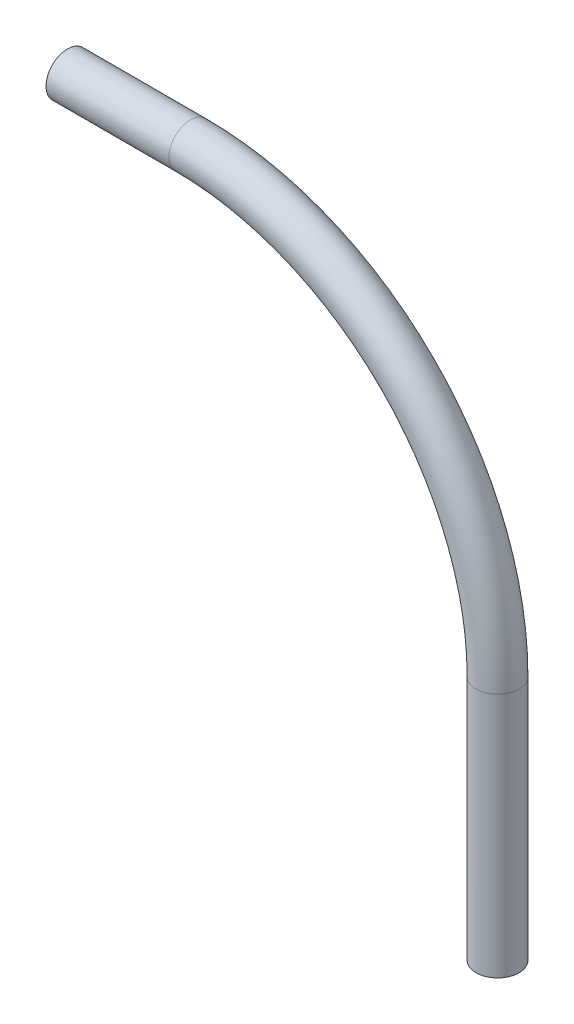
ISO-10303-21;
HEADER;
FILE_DESCRIPTION(('STEP AP214'),'2;1');
FILE_NAME('part.step','',(''),(''),'','','');
FILE_SCHEMA(('AUTOMOTIVE_DESIGN { 1 0 10303 214 1 1 1 1 }'));
ENDSEC;
DATA;
#1=APPLICATION_CONTEXT('core data for automotive mechanical design processes');
#2=APPLICATION_PROTOCOL_DEFINITION('international standard','automotive_design',2000,#1);
#3=PRODUCT_CONTEXT('',#1,'mechanical');
#4=PRODUCT('Part','Part','',(#3));
#5=PRODUCT_RELATED_PRODUCT_CATEGORY('part','',(#4));
#6=PRODUCT_DEFINITION_FORMATION('','',#4);
#7=PRODUCT_DEFINITION_CONTEXT('part definition',#1,'design');
#8=PRODUCT_DEFINITION('design','',#6,#7);
#9=PRODUCT_DEFINITION_SHAPE('','',#8);
#10=(LENGTH_UNIT() NAMED_UNIT(*) SI_UNIT(.MILLI.,.METRE.));
#11=(NAMED_UNIT(*) PLANE_ANGLE_UNIT() SI_UNIT($,.RADIAN.));
#12=(NAMED_UNIT(*) SI_UNIT($,.STERADIAN.) SOLID_ANGLE_UNIT());
#13=UNCERTAINTY_MEASURE_WITH_UNIT(LENGTH_MEASURE(1.E-05),#10,'distance_accuracy_value','');
#14=(GEOMETRIC_REPRESENTATION_CONTEXT(3) GLOBAL_UNCERTAINTY_ASSIGNED_CONTEXT((#13)) GLOBAL_UNIT_ASSIGNED_CONTEXT((#10,
#11,#12)) REPRESENTATION_CONTEXT('',''));
#15=CARTESIAN_POINT('',(0.,0.,0.));
#16=DIRECTION('',(0.,0.,1.));
#17=DIRECTION('',(1.,0.,0.));
#18=AXIS2_PLACEMENT_3D('',#15,#16,#17);
#19=CARTESIAN_POINT('',(0.,0.,0.));
#20=DIRECTION('',(1.,0.,0.));
#21=DIRECTION('',(0.,0.,-1.));
#22=AXIS2_PLACEMENT_3D('',#19,#20,#21);
#23=PLANE('',#22);
#24=CARTESIAN_POINT('',(0.,0.,0.));
#25=DIRECTION('',(1.,0.,0.));
#26=DIRECTION('',(0.,0.,-1.));
#27=AXIS2_PLACEMENT_3D('',#24,#25,#26);
#28=CIRCLE('',#27,3.5);
#29=CARTESIAN_POINT('',(0.,0.,-3.5));
#30=VERTEX_POINT('',#29);
#31=EDGE_CURVE('E44',#30,#30,#28,.T.);
#32=ORIENTED_EDGE('',*,*,#31,.F.);
#33=EDGE_LOOP('',(#32));
#34=FACE_BOUND('',#33,.T.);
#35=ADVANCED_FACE('F30',(#34),#23,.F.);
#36=CARTESIAN_POINT('',(70.,-90.,0.));
#37=DIRECTION('',(0.,-1.,0.));
#38=DIRECTION('',(0.,0.,-1.));
#39=AXIS2_PLACEMENT_3D('',#36,#37,#38);
#40=PLANE('',#39);
#41=CARTESIAN_POINT('',(70.,-90.,0.));
#42=DIRECTION('',(0.,-1.,0.));
#43=DIRECTION('',(0.,0.,-1.));
#44=AXIS2_PLACEMENT_3D('',#41,#42,#43);
#45=CIRCLE('',#44,3.5);
#46=CARTESIAN_POINT('',(70.,-90.,-3.5));
#47=VERTEX_POINT('',#46);
#48=EDGE_CURVE('E10',#47,#47,#45,.T.);
#49=ORIENTED_EDGE('',*,*,#48,.T.);
#50=EDGE_LOOP('',(#49));
#51=FACE_BOUND('',#50,.T.);
#52=ADVANCED_FACE('F53',(#51),#40,.T.);
#53=CARTESIAN_POINT('',(0.,0.,0.));
#54=DIRECTION('',(1.,0.,0.));
#55=DIRECTION('',(0.,0.,-1.));
#56=AXIS2_PLACEMENT_3D('',#53,#54,#55);
#57=CYLINDRICAL_SURFACE('',#56,3.5);
#58=CARTESIAN_POINT('',(20.,0.,0.));
#59=DIRECTION('',(1.,0.,0.));
#60=DIRECTION('',(0.,0.,-1.));
#61=AXIS2_PLACEMENT_3D('',#58,#59,#60);
#62=CIRCLE('',#61,3.5);
#63=CARTESIAN_POINT('',(20.,3.5,0.));
#64=VERTEX_POINT('',#63);
#65=EDGE_CURVE('E40',#64,#64,#62,.T.);
#66=ORIENTED_EDGE('',*,*,#65,.F.);
#67=EDGE_LOOP('',(#66));
#68=FACE_BOUND('',#67,.T.);
#69=ORIENTED_EDGE('',*,*,#31,.T.);
#70=EDGE_LOOP('',(#69));
#71=FACE_BOUND('',#70,.T.);
#72=ADVANCED_FACE('F50',(#68,#71),#57,.T.);
#73=CARTESIAN_POINT('',(20.,-50.,0.));
#74=DIRECTION('',(0.,0.,-1.));
#75=DIRECTION('',(-1.,0.,0.));
#76=AXIS2_PLACEMENT_3D('',#73,#74,#75);
#77=TOROIDAL_SURFACE('',#76,50.,3.5);
#78=CARTESIAN_POINT('',(70.,-50.,0.));
#79=DIRECTION('',(0.,-1.,0.));
#80=DIRECTION('',(0.,0.,-1.));
#81=AXIS2_PLACEMENT_3D('',#78,#79,#80);
#82=CIRCLE('',#81,3.5);
#83=CARTESIAN_POINT('',(73.5,-50.,0.));
#84=VERTEX_POINT('',#83);
#85=EDGE_CURVE('E36',#84,#84,#82,.T.);
#86=CARTESIAN_POINT('',(20.,-50.,0.));
#87=DIRECTION('',(0.,0.,-1.));
#88=DIRECTION('',(-1.,0.,0.));
#89=AXIS2_PLACEMENT_3D('',#86,#87,#88);
#90=CIRCLE('',#89,53.5);
#91=EDGE_CURVE('',#64,#84,#90,.T.);
#92=ORIENTED_EDGE('',*,*,#65,.T.);
#93=ORIENTED_EDGE('',*,*,#85,.F.);
#94=ORIENTED_EDGE('',*,*,#91,.T.);
#95=ORIENTED_EDGE('',*,*,#91,.F.);
#96=EDGE_LOOP('',(#92,#94,#93,#95));
#97=FACE_BOUND('',#96,.T.);
#98=ADVANCED_FACE('F59',(#97),#77,.T.);
#99=CARTESIAN_POINT('',(70.,-50.,0.));
#100=DIRECTION('',(0.,-1.,0.));
#101=DIRECTION('',(0.,0.,-1.));
#102=AXIS2_PLACEMENT_3D('',#99,#100,#101);
#103=CYLINDRICAL_SURFACE('',#102,3.5);
#104=ORIENTED_EDGE('',*,*,#48,.F.);
#105=EDGE_LOOP('',(#104));
#106=FACE_BOUND('',#105,.T.);
#107=ORIENTED_EDGE('',*,*,#85,.T.);
#108=EDGE_LOOP('',(#107));
#109=FACE_BOUND('',#108,.T.);
#110=ADVANCED_FACE('F57',(#106,#109),#103,.T.);
#111=CLOSED_SHELL('',(#35,#52,#72,#98,#110));
#112=MANIFOLD_SOLID_BREP('B2',#111);
#113=ADVANCED_BREP_SHAPE_REPRESENTATION('',(#18,#112),#14);
#114=SHAPE_DEFINITION_REPRESENTATION(#9,#113);
ENDSEC;
END-ISO-10303-21;
